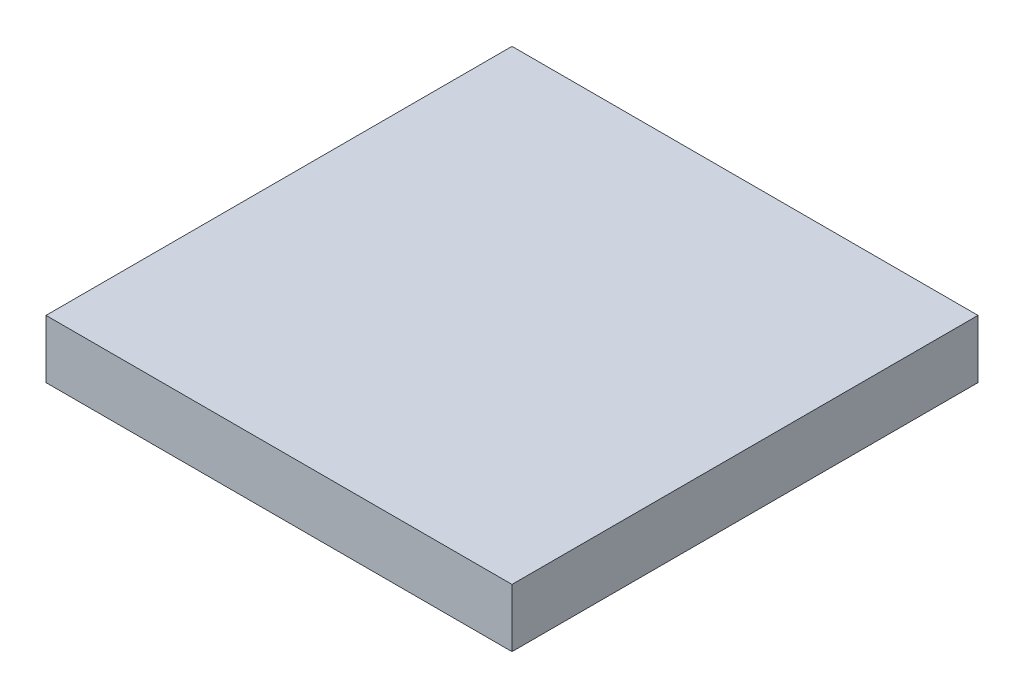
ISO-10303-21;
HEADER;
FILE_DESCRIPTION(('STEP AP214'),'2;1');
FILE_NAME('part.step','',(''),(''),'','','');
FILE_SCHEMA(('AUTOMOTIVE_DESIGN { 1 0 10303 214 1 1 1 1 }'));
ENDSEC;
DATA;
#1=APPLICATION_CONTEXT('core data for automotive mechanical design processes');
#2=APPLICATION_PROTOCOL_DEFINITION('international standard','automotive_design',2000,#1);
#3=PRODUCT_CONTEXT('',#1,'mechanical');
#4=PRODUCT('Part','Part','',(#3));
#5=PRODUCT_RELATED_PRODUCT_CATEGORY('part','',(#4));
#6=PRODUCT_DEFINITION_FORMATION('','',#4);
#7=PRODUCT_DEFINITION_CONTEXT('part definition',#1,'design');
#8=PRODUCT_DEFINITION('design','',#6,#7);
#9=PRODUCT_DEFINITION_SHAPE('','',#8);
#10=(LENGTH_UNIT() NAMED_UNIT(*) SI_UNIT(.MILLI.,.METRE.));
#11=(NAMED_UNIT(*) PLANE_ANGLE_UNIT() SI_UNIT($,.RADIAN.));
#12=(NAMED_UNIT(*) SI_UNIT($,.STERADIAN.) SOLID_ANGLE_UNIT());
#13=UNCERTAINTY_MEASURE_WITH_UNIT(LENGTH_MEASURE(1.E-05),#10,'distance_accuracy_value','');
#14=(GEOMETRIC_REPRESENTATION_CONTEXT(3) GLOBAL_UNCERTAINTY_ASSIGNED_CONTEXT((#13)) GLOBAL_UNIT_ASSIGNED_CONTEXT((#10,
#11,#12)) REPRESENTATION_CONTEXT('',''));
#15=CARTESIAN_POINT('',(0.,0.,0.));
#16=DIRECTION('',(0.,0.,1.));
#17=DIRECTION('',(1.,0.,0.));
#18=AXIS2_PLACEMENT_3D('',#15,#16,#17);
#19=CARTESIAN_POINT('',(12.7,3.175,12.7));
#20=DIRECTION('',(-1.,0.,0.));
#21=DIRECTION('',(0.,0.,1.));
#22=AXIS2_PLACEMENT_3D('',#19,#20,#21);
#23=PLANE('',#22);
#24=DIRECTION('',(0.,0.,-1.));
#25=VECTOR('',#24,1.);
#26=CARTESIAN_POINT('',(12.7,0.,12.7));
#27=LINE('',#26,#25);
#28=CARTESIAN_POINT('',(12.7,0.,12.7));
#29=VERTEX_POINT('',#28);
#30=CARTESIAN_POINT('',(12.7,0.,-12.7));
#31=VERTEX_POINT('',#30);
#32=EDGE_CURVE('E301',#29,#31,#27,.T.);
#33=ORIENTED_EDGE('',*,*,#32,.T.);
#34=DIRECTION('',(0.,-1.,0.));
#35=VECTOR('',#34,1.);
#36=CARTESIAN_POINT('',(12.7,3.175,-12.7));
#37=LINE('',#36,#35);
#38=CARTESIAN_POINT('',(12.7,3.175,-12.7));
#39=VERTEX_POINT('',#38);
#40=EDGE_CURVE('E12',#39,#31,#37,.T.);
#41=ORIENTED_EDGE('',*,*,#40,.F.);
#42=DIRECTION('',(0.,0.,-1.));
#43=VECTOR('',#42,1.);
#44=CARTESIAN_POINT('',(12.7,3.175,12.7));
#45=LINE('',#44,#43);
#46=CARTESIAN_POINT('',(12.7,3.175,12.7));
#47=VERTEX_POINT('',#46);
#48=EDGE_CURVE('E435',#47,#39,#45,.T.);
#49=ORIENTED_EDGE('',*,*,#48,.F.);
#50=DIRECTION('',(0.,-1.,0.));
#51=VECTOR('',#50,1.);
#52=CARTESIAN_POINT('',(12.7,3.175,12.7));
#53=LINE('',#52,#51);
#54=EDGE_CURVE('E445',#47,#29,#53,.T.);
#55=ORIENTED_EDGE('',*,*,#54,.T.);
#56=EDGE_LOOP('',(#33,#41,#49,#55));
#57=FACE_BOUND('',#56,.T.);
#58=ADVANCED_FACE('F60',(#57),#23,.F.);
#59=CARTESIAN_POINT('',(-12.7,3.175,-12.7));
#60=DIRECTION('',(0.,0.,1.));
#61=DIRECTION('',(1.,0.,0.));
#62=AXIS2_PLACEMENT_3D('',#59,#60,#61);
#63=PLANE('',#62);
#64=DIRECTION('',(-1.,0.,0.));
#65=VECTOR('',#64,1.);
#66=CARTESIAN_POINT('',(-12.7,0.,-12.7));
#67=LINE('',#66,#65);
#68=CARTESIAN_POINT('',(-12.7,0.,-12.7));
#69=VERTEX_POINT('',#68);
#70=EDGE_CURVE('E448',#31,#69,#67,.T.);
#71=ORIENTED_EDGE('',*,*,#70,.T.);
#72=DIRECTION('',(0.,-1.,0.));
#73=VECTOR('',#72,1.);
#74=CARTESIAN_POINT('',(-12.7,3.175,-12.7));
#75=LINE('',#74,#73);
#76=CARTESIAN_POINT('',(-12.7,3.175,-12.7));
#77=VERTEX_POINT('',#76);
#78=EDGE_CURVE('E67',#77,#69,#75,.T.);
#79=ORIENTED_EDGE('',*,*,#78,.F.);
#80=DIRECTION('',(-1.,0.,0.));
#81=VECTOR('',#80,1.);
#82=CARTESIAN_POINT('',(-12.7,3.175,-12.7));
#83=LINE('',#82,#81);
#84=EDGE_CURVE('E438',#39,#77,#83,.T.);
#85=ORIENTED_EDGE('',*,*,#84,.F.);
#86=ORIENTED_EDGE('',*,*,#40,.T.);
#87=EDGE_LOOP('',(#71,#79,#85,#86));
#88=FACE_BOUND('',#87,.T.);
#89=ADVANCED_FACE('F478',(#88),#63,.F.);
#90=CARTESIAN_POINT('',(-12.7,3.175,12.7));
#91=DIRECTION('',(1.,0.,0.));
#92=DIRECTION('',(0.,0.,-1.));
#93=AXIS2_PLACEMENT_3D('',#90,#91,#92);
#94=PLANE('',#93);
#95=DIRECTION('',(0.,0.,1.));
#96=VECTOR('',#95,1.);
#97=CARTESIAN_POINT('',(-12.7,0.,12.7));
#98=LINE('',#97,#96);
#99=CARTESIAN_POINT('',(-12.7,0.,12.7));
#100=VERTEX_POINT('',#99);
#101=EDGE_CURVE('E450',#69,#100,#98,.T.);
#102=ORIENTED_EDGE('',*,*,#101,.T.);
#103=DIRECTION('',(0.,-1.,0.));
#104=VECTOR('',#103,1.);
#105=CARTESIAN_POINT('',(-12.7,3.175,12.7));
#106=LINE('',#105,#104);
#107=CARTESIAN_POINT('',(-12.7,3.175,12.7));
#108=VERTEX_POINT('',#107);
#109=EDGE_CURVE('E455',#108,#100,#106,.T.);
#110=ORIENTED_EDGE('',*,*,#109,.F.);
#111=DIRECTION('',(0.,0.,1.));
#112=VECTOR('',#111,1.);
#113=CARTESIAN_POINT('',(-12.7,3.175,12.7));
#114=LINE('',#113,#112);
#115=EDGE_CURVE('E441',#77,#108,#114,.T.);
#116=ORIENTED_EDGE('',*,*,#115,.F.);
#117=ORIENTED_EDGE('',*,*,#78,.T.);
#118=EDGE_LOOP('',(#102,#110,#116,#117));
#119=FACE_BOUND('',#118,.T.);
#120=ADVANCED_FACE('F462',(#119),#94,.F.);
#121=CARTESIAN_POINT('',(-12.7,3.175,12.7));
#122=DIRECTION('',(0.,0.,-1.));
#123=DIRECTION('',(-1.,0.,0.));
#124=AXIS2_PLACEMENT_3D('',#121,#122,#123);
#125=PLANE('',#124);
#126=DIRECTION('',(1.,0.,0.));
#127=VECTOR('',#126,1.);
#128=CARTESIAN_POINT('',(-12.7,0.,12.7));
#129=LINE('',#128,#127);
#130=EDGE_CURVE('E439',#100,#29,#129,.T.);
#131=ORIENTED_EDGE('',*,*,#130,.T.);
#132=ORIENTED_EDGE('',*,*,#54,.F.);
#133=DIRECTION('',(1.,0.,0.));
#134=VECTOR('',#133,1.);
#135=CARTESIAN_POINT('',(-12.7,3.175,12.7));
#136=LINE('',#135,#134);
#137=EDGE_CURVE('E443',#108,#47,#136,.T.);
#138=ORIENTED_EDGE('',*,*,#137,.F.);
#139=ORIENTED_EDGE('',*,*,#109,.T.);
#140=EDGE_LOOP('',(#131,#132,#138,#139));
#141=FACE_BOUND('',#140,.T.);
#142=ADVANCED_FACE('F471',(#141),#125,.F.);
#143=CARTESIAN_POINT('',(0.,3.175,0.));
#144=DIRECTION('',(0.,-1.,0.));
#145=DIRECTION('',(0.,0.,-1.));
#146=AXIS2_PLACEMENT_3D('',#143,#144,#145);
#147=PLANE('',#146);
#148=ORIENTED_EDGE('',*,*,#48,.T.);
#149=ORIENTED_EDGE('',*,*,#84,.T.);
#150=ORIENTED_EDGE('',*,*,#115,.T.);
#151=ORIENTED_EDGE('',*,*,#137,.T.);
#152=EDGE_LOOP('',(#148,#149,#150,#151));
#153=FACE_BOUND('',#152,.T.);
#154=ADVANCED_FACE('F477',(#153),#147,.F.);
#155=CARTESIAN_POINT('',(0.,0.,0.));
#156=DIRECTION('',(0.,-1.,0.));
#157=DIRECTION('',(0.,0.,-1.));
#158=AXIS2_PLACEMENT_3D('',#155,#156,#157);
#159=PLANE('',#158);
#160=CARTESIAN_POINT('',(-11.1125,0.,1.5875));
#161=DIRECTION('',(0.,-1.,0.));
#162=DIRECTION('',(0.,0.,-1.));
#163=AXIS2_PLACEMENT_3D('',#160,#161,#162);
#164=CIRCLE('',#163,0.793749999999999);
#165=CARTESIAN_POINT('',(-10.31875,0.,1.5875));
#166=VERTEX_POINT('',#165);
#167=CARTESIAN_POINT('',(-11.1125,0.,0.793750000000005));
#168=VERTEX_POINT('',#167);
#169=EDGE_CURVE('E74',#166,#168,#164,.T.);
#170=ORIENTED_EDGE('',*,*,#169,.F.);
#171=DIRECTION('',(1.,0.,0.));
#172=VECTOR('',#171,1.);
#173=CARTESIAN_POINT('',(0.,0.,1.5875));
#174=LINE('',#173,#172);
#175=CARTESIAN_POINT('',(-8.73124999999999,0.,1.5875));
#176=VERTEX_POINT('',#175);
#177=EDGE_CURVE('E264',#166,#176,#174,.T.);
#178=ORIENTED_EDGE('',*,*,#177,.T.);
#179=CARTESIAN_POINT('',(-7.93749999999999,0.,1.58749999999999));
#180=DIRECTION('',(0.,-1.,0.));
#181=DIRECTION('',(0.,0.,-1.));
#182=AXIS2_PLACEMENT_3D('',#179,#180,#181);
#183=CIRCLE('',#182,0.79375);
#184=CARTESIAN_POINT('',(-7.9375,0.,0.793749999999989));
#185=VERTEX_POINT('',#184);
#186=EDGE_CURVE('E267',#185,#176,#183,.T.);
#187=ORIENTED_EDGE('',*,*,#186,.F.);
#188=DIRECTION('',(0.,0.,-1.));
#189=VECTOR('',#188,1.);
#190=CARTESIAN_POINT('',(-7.9375,0.,0.));
#191=LINE('',#190,#189);
#192=CARTESIAN_POINT('',(-7.9375,0.,-0.793750000000015));
#193=VERTEX_POINT('',#192);
#194=EDGE_CURVE('E294',#185,#193,#191,.T.);
#195=ORIENTED_EDGE('',*,*,#194,.T.);
#196=CARTESIAN_POINT('',(-7.93750000000002,0.,-1.58750000000002));
#197=DIRECTION('',(0.,-1.,0.));
#198=DIRECTION('',(0.,0.,-1.));
#199=AXIS2_PLACEMENT_3D('',#196,#197,#198);
#200=CIRCLE('',#199,0.793750000000001);
#201=CARTESIAN_POINT('',(-8.73125000000002,0.,-1.5875));
#202=VERTEX_POINT('',#201);
#203=EDGE_CURVE('E291',#202,#193,#200,.T.);
#204=ORIENTED_EDGE('',*,*,#203,.F.);
#205=DIRECTION('',(1.,0.,0.));
#206=VECTOR('',#205,1.);
#207=CARTESIAN_POINT('',(0.,0.,-1.5875));
#208=LINE('',#207,#206);
#209=CARTESIAN_POINT('',(-10.31875,0.,-1.5875));
#210=VERTEX_POINT('',#209);
#211=EDGE_CURVE('E288',#210,#202,#208,.T.);
#212=ORIENTED_EDGE('',*,*,#211,.F.);
#213=CARTESIAN_POINT('',(-11.1125,0.,-1.5875));
#214=DIRECTION('',(0.,-1.,0.));
#215=DIRECTION('',(0.,0.,-1.));
#216=AXIS2_PLACEMENT_3D('',#213,#214,#215);
#217=CIRCLE('',#216,0.793749999999999);
#218=CARTESIAN_POINT('',(-11.1125,0.,-0.79375));
#219=VERTEX_POINT('',#218);
#220=EDGE_CURVE('E285',#219,#210,#217,.T.);
#221=ORIENTED_EDGE('',*,*,#220,.F.);
#222=DIRECTION('',(0.,0.,-1.));
#223=VECTOR('',#222,1.);
#224=CARTESIAN_POINT('',(-11.1125,0.,0.));
#225=LINE('',#224,#223);
#226=EDGE_CURVE('E283',#168,#219,#225,.T.);
#227=ORIENTED_EDGE('',*,*,#226,.F.);
#228=EDGE_LOOP('',(#170,#178,#187,#195,#204,#212,#221,#227));
#229=FACE_BOUND('',#228,.T.);
#230=CARTESIAN_POINT('',(6.93106532850716,0.,8.82995729955647));
#231=DIRECTION('',(0.,-1.,0.));
#232=DIRECTION('',(0.,0.,-1.));
#233=AXIS2_PLACEMENT_3D('',#230,#231,#232);
#234=CIRCLE('',#233,0.793749999998903);
#235=CARTESIAN_POINT('',(6.53419032850771,0.,8.14254963530352));
#236=VERTEX_POINT('',#235);
#237=CARTESIAN_POINT('',(6.24365766425421,0.,9.22683229955592));
#238=VERTEX_POINT('',#237);
#239=EDGE_CURVE('E82',#236,#238,#234,.T.);
#240=ORIENTED_EDGE('',*,*,#239,.F.);
#241=DIRECTION('',(-0.5,0.,-0.866025403784439));
#242=VECTOR('',#241,1.);
#243=CARTESIAN_POINT('',(1.3748153285065,0.,-0.793749999999254));
#244=LINE('',#243,#242);
#245=CARTESIAN_POINT('',(5.7404403285063,0.,6.76773430679328));
#246=VERTEX_POINT('',#245);
#247=EDGE_CURVE('E331',#236,#246,#244,.T.);
#248=ORIENTED_EDGE('',*,*,#247,.T.);
#249=CARTESIAN_POINT('',(5.34356532850717,0.,6.08032664254088));
#250=DIRECTION('',(0.,-1.,0.));
#251=DIRECTION('',(0.,0.,-1.));
#252=AXIS2_PLACEMENT_3D('',#249,#250,#251);
#253=CIRCLE('',#252,0.793749999998273);
#254=CARTESIAN_POINT('',(4.65615766425476,0.,6.47720164254001));
#255=VERTEX_POINT('',#254);
#256=EDGE_CURVE('E334',#255,#246,#253,.T.);
#257=ORIENTED_EDGE('',*,*,#256,.F.);
#258=DIRECTION('',(-0.866025403784439,0.,0.499999999999999));
#259=VECTOR('',#258,1.);
#260=CARTESIAN_POINT('',(3.96875000000065,0.,6.87407664254013));
#261=LINE('',#260,#259);
#262=CARTESIAN_POINT('',(3.2813423357464,0.,7.27095164254034));
#263=VERTEX_POINT('',#262);
#264=EDGE_CURVE('E338',#255,#263,#261,.T.);
#265=ORIENTED_EDGE('',*,*,#264,.T.);
#266=CARTESIAN_POINT('',(2.59393467149157,0.,7.66782664254088));
#267=DIRECTION('',(0.,-1.,0.));
#268=DIRECTION('',(0.,0.,-1.));
#269=AXIS2_PLACEMENT_3D('',#266,#267,#268);
#270=CIRCLE('',#269,0.793750000001067);
#271=CARTESIAN_POINT('',(2.99080967149211,0.,8.3552343067957));
#272=VERTEX_POINT('',#271);
#273=EDGE_CURVE('E341',#272,#263,#270,.T.);
#274=ORIENTED_EDGE('',*,*,#273,.F.);
#275=DIRECTION('',(-0.5,0.,-0.866025403784439));
#276=VECTOR('',#275,1.);
#277=CARTESIAN_POINT('',(-1.37481532850909,0.,0.793750000000747));
#278=LINE('',#277,#276);
#279=CARTESIAN_POINT('',(3.78455967149072,0.,9.73004963530109));
#280=VERTEX_POINT('',#279);
#281=EDGE_CURVE('E344',#280,#272,#278,.T.);
#282=ORIENTED_EDGE('',*,*,#281,.F.);
#283=CARTESIAN_POINT('',(4.18143467149157,0.,10.4174572995565));
#284=DIRECTION('',(0.,-1.,0.));
#285=DIRECTION('',(0.,0.,-1.));
#286=AXIS2_PLACEMENT_3D('',#283,#284,#285);
#287=CIRCLE('',#286,0.793750000001707);
#288=CARTESIAN_POINT('',(4.86884233574695,0.,10.0205822995556));
#289=VERTEX_POINT('',#288);
#290=EDGE_CURVE('E347',#289,#280,#287,.T.);
#291=ORIENTED_EDGE('',*,*,#290,.F.);
#292=DIRECTION('',(-0.866025403784439,0.,0.499999999999999));
#293=VECTOR('',#292,1.);
#294=CARTESIAN_POINT('',(5.55625000000065,0.,9.62370729955573));
#295=LINE('',#294,#293);
#296=EDGE_CURVE('E350',#238,#289,#295,.T.);
#297=ORIENTED_EDGE('',*,*,#296,.F.);
#298=EDGE_LOOP('',(#240,#248,#257,#265,#274,#282,#291,#297));
#299=FACE_BOUND('',#298,.T.);
#300=CARTESIAN_POINT('',(6.93106532850912,0.,-8.82995729955308));
#301=DIRECTION('',(0.,-1.,0.));
#302=DIRECTION('',(0.,0.,-1.));
#303=AXIS2_PLACEMENT_3D('',#300,#301,#302);
#304=CIRCLE('',#303,0.793749999999967);
#305=CARTESIAN_POINT('',(6.24365766425526,0.,-9.22683229955306));
#306=VERTEX_POINT('',#305);
#307=CARTESIAN_POINT('',(6.53419032850914,0.,-8.14254963529921));
#308=VERTEX_POINT('',#307);
#309=EDGE_CURVE('E408',#306,#308,#304,.T.);
#310=ORIENTED_EDGE('',*,*,#309,.F.);
#311=DIRECTION('',(0.866025403784438,0.,0.500000000000001));
#312=VECTOR('',#311,1.);
#313=CARTESIAN_POINT('',(5.5562499999997,0.,-9.62370729955402));
#314=LINE('',#313,#312);
#315=CARTESIAN_POINT('',(4.86884233574562,0.,-10.0205822995541));
#316=VERTEX_POINT('',#315);
#317=EDGE_CURVE('E410',#316,#306,#314,.T.);
#318=ORIENTED_EDGE('',*,*,#317,.F.);
#319=CARTESIAN_POINT('',(4.18143467149353,0.,-10.4174572995531));
#320=DIRECTION('',(0.,-1.,0.));
#321=DIRECTION('',(0.,0.,-1.));
#322=AXIS2_PLACEMENT_3D('',#319,#320,#321);
#323=CIRCLE('',#322,0.793749999997901);
#324=CARTESIAN_POINT('',(3.78455967149458,0.,-9.730049635301));
#325=VERTEX_POINT('',#324);
#326=EDGE_CURVE('E330',#325,#316,#323,.T.);
#327=ORIENTED_EDGE('',*,*,#326,.F.);
#328=DIRECTION('',(-0.5,0.,0.866025403784438));
#329=VECTOR('',#328,1.);
#330=CARTESIAN_POINT('',(-1.37481532850616,0.,-0.793749999999055));
#331=LINE('',#330,#329);
#332=CARTESIAN_POINT('',(2.99080967149353,0.,-8.35523430679139));
#333=VERTEX_POINT('',#332);
#334=EDGE_CURVE('E392',#325,#333,#331,.T.);
#335=ORIENTED_EDGE('',*,*,#334,.T.);
#336=CARTESIAN_POINT('',(2.59393467149353,0.,-7.66782664253749));
#337=DIRECTION('',(0.,-1.,0.));
#338=DIRECTION('',(0.,0.,-1.));
#339=AXIS2_PLACEMENT_3D('',#336,#337,#338);
#340=CIRCLE('',#339,0.793750000000004);
#341=CARTESIAN_POINT('',(3.28134233574743,0.,-7.27095164253749));
#342=VERTEX_POINT('',#341);
#343=EDGE_CURVE('E395',#342,#333,#340,.T.);
#344=ORIENTED_EDGE('',*,*,#343,.F.);
#345=DIRECTION('',(0.866025403784438,0.,0.500000000000002));
#346=VECTOR('',#345,1.);
#347=CARTESIAN_POINT('',(3.9687499999997,0.,-6.87407664253843));
#348=LINE('',#347,#346);
#349=CARTESIAN_POINT('',(4.65615766425344,0.,-6.47720164253852));
#350=VERTEX_POINT('',#349);
#351=EDGE_CURVE('E399',#342,#350,#348,.T.);
#352=ORIENTED_EDGE('',*,*,#351,.T.);
#353=CARTESIAN_POINT('',(5.34356532850912,0.,-6.08032664253749));
#354=DIRECTION('',(0.,-1.,0.));
#355=DIRECTION('',(0.,0.,-1.));
#356=AXIS2_PLACEMENT_3D('',#353,#354,#355);
#357=CIRCLE('',#356,0.79375000000206);
#358=CARTESIAN_POINT('',(5.74044032851016,0.,-6.76773430679317));
#359=VERTEX_POINT('',#358);
#360=EDGE_CURVE('E402',#359,#350,#357,.T.);
#361=ORIENTED_EDGE('',*,*,#360,.F.);
#362=DIRECTION('',(-0.500000000000001,0.,0.866025403784438));
#363=VECTOR('',#362,1.);
#364=CARTESIAN_POINT('',(1.37481532850943,0.,0.793750000000946));
#365=LINE('',#364,#363);
#366=EDGE_CURVE('E405',#308,#359,#365,.T.);
#367=ORIENTED_EDGE('',*,*,#366,.F.);
#368=EDGE_LOOP('',(#310,#318,#327,#335,#344,#352,#361,#367));
#369=FACE_BOUND('',#368,.T.);
#370=ORIENTED_EDGE('',*,*,#32,.F.);
#371=ORIENTED_EDGE('',*,*,#130,.F.);
#372=ORIENTED_EDGE('',*,*,#101,.F.);
#373=ORIENTED_EDGE('',*,*,#70,.F.);
#374=EDGE_LOOP('',(#370,#371,#372,#373));
#375=FACE_BOUND('',#374,.T.);
#376=ADVANCED_FACE('F468',(#229,#299,#369,#375),#159,.T.);
#377=CARTESIAN_POINT('',(6.93106532850912,1.5875,-8.82995729955308));
#378=DIRECTION('',(0.,-1.,0.));
#379=DIRECTION('',(0.,0.,-1.));
#380=AXIS2_PLACEMENT_3D('',#377,#378,#379);
#381=CYLINDRICAL_SURFACE('',#380,0.793749999999967);
#382=ORIENTED_EDGE('',*,*,#309,.T.);
#383=DIRECTION('',(0.,-1.,0.));
#384=VECTOR('',#383,1.);
#385=CARTESIAN_POINT('',(6.53419032850914,1.5875,-8.14254963529921));
#386=LINE('',#385,#384);
#387=CARTESIAN_POINT('',(6.53419032850914,1.5875,-8.14254963529921));
#388=VERTEX_POINT('',#387);
#389=EDGE_CURVE('E379',#388,#308,#386,.T.);
#390=ORIENTED_EDGE('',*,*,#389,.F.);
#391=CARTESIAN_POINT('',(6.93106532850912,1.5875,-8.82995729955308));
#392=DIRECTION('',(0.,-1.,0.));
#393=DIRECTION('',(0.,0.,-1.));
#394=AXIS2_PLACEMENT_3D('',#391,#392,#393);
#395=CIRCLE('',#394,0.793749999999967);
#396=CARTESIAN_POINT('',(6.24365766425526,1.5875,-9.22683229955306));
#397=VERTEX_POINT('',#396);
#398=EDGE_CURVE('E427',#397,#388,#395,.T.);
#399=ORIENTED_EDGE('',*,*,#398,.F.);
#400=DIRECTION('',(0.,-1.,0.));
#401=VECTOR('',#400,1.);
#402=CARTESIAN_POINT('',(6.24365766425526,1.5875,-9.22683229955306));
#403=LINE('',#402,#401);
#404=EDGE_CURVE('E377',#397,#306,#403,.T.);
#405=ORIENTED_EDGE('',*,*,#404,.T.);
#406=EDGE_LOOP('',(#382,#390,#399,#405));
#407=FACE_BOUND('',#406,.T.);
#408=ADVANCED_FACE('F490',(#407),#381,.F.);
#409=CARTESIAN_POINT('',(0.,1.5875,0.));
#410=DIRECTION('',(0.,-1.,0.));
#411=DIRECTION('',(0.,0.,-1.));
#412=AXIS2_PLACEMENT_3D('',#409,#410,#411);
#413=PLANE('',#412);
#414=ORIENTED_EDGE('',*,*,#398,.T.);
#415=DIRECTION('',(-0.500000000000001,0.,0.866025403784438));
#416=VECTOR('',#415,1.);
#417=CARTESIAN_POINT('',(1.37481532850943,1.5875,0.793750000000946));
#418=LINE('',#417,#416);
#419=CARTESIAN_POINT('',(5.74044032851016,1.5875,-6.76773430679317));
#420=VERTEX_POINT('',#419);
#421=EDGE_CURVE('E424',#388,#420,#418,.T.);
#422=ORIENTED_EDGE('',*,*,#421,.T.);
#423=CARTESIAN_POINT('',(5.34356532850912,1.5875,-6.08032664253749));
#424=DIRECTION('',(0.,-1.,0.));
#425=DIRECTION('',(0.,0.,-1.));
#426=AXIS2_PLACEMENT_3D('',#423,#424,#425);
#427=CIRCLE('',#426,0.79375000000206);
#428=CARTESIAN_POINT('',(4.65615766425344,1.5875,-6.47720164253852));
#429=VERTEX_POINT('',#428);
#430=EDGE_CURVE('E421',#420,#429,#427,.T.);
#431=ORIENTED_EDGE('',*,*,#430,.T.);
#432=DIRECTION('',(0.866025403784438,0.,0.500000000000002));
#433=VECTOR('',#432,1.);
#434=CARTESIAN_POINT('',(3.9687499999997,1.5875,-6.87407664253843));
#435=LINE('',#434,#433);
#436=CARTESIAN_POINT('',(3.28134233574743,1.5875,-7.27095164253749));
#437=VERTEX_POINT('',#436);
#438=EDGE_CURVE('E419',#437,#429,#435,.T.);
#439=ORIENTED_EDGE('',*,*,#438,.F.);
#440=CARTESIAN_POINT('',(2.59393467149353,1.5875,-7.66782664253749));
#441=DIRECTION('',(0.,-1.,0.));
#442=DIRECTION('',(0.,0.,-1.));
#443=AXIS2_PLACEMENT_3D('',#440,#441,#442);
#444=CIRCLE('',#443,0.793750000000004);
#445=CARTESIAN_POINT('',(2.99080967149353,1.5875,-8.35523430679139));
#446=VERTEX_POINT('',#445);
#447=EDGE_CURVE('E416',#437,#446,#444,.T.);
#448=ORIENTED_EDGE('',*,*,#447,.T.);
#449=DIRECTION('',(-0.5,0.,0.866025403784438));
#450=VECTOR('',#449,1.);
#451=CARTESIAN_POINT('',(-1.37481532850616,1.5875,-0.793749999999055));
#452=LINE('',#451,#450);
#453=CARTESIAN_POINT('',(3.78455967149458,1.5875,-9.730049635301));
#454=VERTEX_POINT('',#453);
#455=EDGE_CURVE('E376',#454,#446,#452,.T.);
#456=ORIENTED_EDGE('',*,*,#455,.F.);
#457=CARTESIAN_POINT('',(4.18143467149353,1.5875,-10.4174572995531));
#458=DIRECTION('',(0.,-1.,0.));
#459=DIRECTION('',(0.,0.,-1.));
#460=AXIS2_PLACEMENT_3D('',#457,#458,#459);
#461=CIRCLE('',#460,0.793749999997901);
#462=CARTESIAN_POINT('',(4.86884233574562,1.5875,-10.0205822995541));
#463=VERTEX_POINT('',#462);
#464=EDGE_CURVE('E396',#454,#463,#461,.T.);
#465=ORIENTED_EDGE('',*,*,#464,.T.);
#466=DIRECTION('',(0.866025403784438,0.,0.500000000000001));
#467=VECTOR('',#466,1.);
#468=CARTESIAN_POINT('',(5.5562499999997,1.5875,-9.62370729955402));
#469=LINE('',#468,#467);
#470=EDGE_CURVE('E430',#463,#397,#469,.T.);
#471=ORIENTED_EDGE('',*,*,#470,.T.);
#472=EDGE_LOOP('',(#414,#422,#431,#439,#448,#456,#465,#471));
#473=FACE_BOUND('',#472,.T.);
#474=ADVANCED_FACE('F494',(#473),#413,.T.);
#475=CARTESIAN_POINT('',(5.5562499999997,1.5875,-9.62370729955402));
#476=DIRECTION('',(0.500000000000001,0.,-0.866025403784438));
#477=DIRECTION('',(-0.866025403784438,0.,-0.500000000000001));
#478=AXIS2_PLACEMENT_3D('',#475,#476,#477);
#479=PLANE('',#478);
#480=ORIENTED_EDGE('',*,*,#317,.T.);
#481=ORIENTED_EDGE('',*,*,#404,.F.);
#482=ORIENTED_EDGE('',*,*,#470,.F.);
#483=DIRECTION('',(0.,-1.,0.));
#484=VECTOR('',#483,1.);
#485=CARTESIAN_POINT('',(4.86884233574562,1.5875,-10.0205822995541));
#486=LINE('',#485,#484);
#487=EDGE_CURVE('E374',#463,#316,#486,.T.);
#488=ORIENTED_EDGE('',*,*,#487,.T.);
#489=EDGE_LOOP('',(#480,#481,#482,#488));
#490=FACE_BOUND('',#489,.T.);
#491=ADVANCED_FACE('F497',(#490),#479,.F.);
#492=CARTESIAN_POINT('',(4.18143467149353,1.5875,-10.4174572995531));
#493=DIRECTION('',(0.,-1.,0.));
#494=DIRECTION('',(0.,0.,-1.));
#495=AXIS2_PLACEMENT_3D('',#492,#493,#494);
#496=CYLINDRICAL_SURFACE('',#495,0.793749999997901);
#497=ORIENTED_EDGE('',*,*,#326,.T.);
#498=ORIENTED_EDGE('',*,*,#487,.F.);
#499=ORIENTED_EDGE('',*,*,#464,.F.);
#500=DIRECTION('',(0.,-1.,0.));
#501=VECTOR('',#500,1.);
#502=CARTESIAN_POINT('',(3.78455967149458,1.5875,-9.730049635301));
#503=LINE('',#502,#501);
#504=EDGE_CURVE('E390',#454,#325,#503,.T.);
#505=ORIENTED_EDGE('',*,*,#504,.T.);
#506=EDGE_LOOP('',(#497,#498,#499,#505));
#507=FACE_BOUND('',#506,.T.);
#508=ADVANCED_FACE('F505',(#507),#496,.F.);
#509=CARTESIAN_POINT('',(-1.37481532850616,1.5875,-0.793749999999055));
#510=DIRECTION('',(0.866025403784438,0.,0.5));
#511=DIRECTION('',(0.500000000000001,0.,-0.866025403784438));
#512=AXIS2_PLACEMENT_3D('',#509,#510,#511);
#513=PLANE('',#512);
#514=ORIENTED_EDGE('',*,*,#334,.F.);
#515=ORIENTED_EDGE('',*,*,#504,.F.);
#516=ORIENTED_EDGE('',*,*,#455,.T.);
#517=DIRECTION('',(0.,-1.,0.));
#518=VECTOR('',#517,1.);
#519=CARTESIAN_POINT('',(2.99080967149353,1.5875,-8.35523430679139));
#520=LINE('',#519,#518);
#521=EDGE_CURVE('E388',#446,#333,#520,.T.);
#522=ORIENTED_EDGE('',*,*,#521,.T.);
#523=EDGE_LOOP('',(#514,#515,#516,#522));
#524=FACE_BOUND('',#523,.T.);
#525=ADVANCED_FACE('F501',(#524),#513,.T.);
#526=CARTESIAN_POINT('',(2.59393467149353,1.5875,-7.66782664253749));
#527=DIRECTION('',(0.,-1.,0.));
#528=DIRECTION('',(0.,0.,-1.));
#529=AXIS2_PLACEMENT_3D('',#526,#527,#528);
#530=CYLINDRICAL_SURFACE('',#529,0.793750000000004);
#531=ORIENTED_EDGE('',*,*,#343,.T.);
#532=ORIENTED_EDGE('',*,*,#521,.F.);
#533=ORIENTED_EDGE('',*,*,#447,.F.);
#534=DIRECTION('',(0.,-1.,0.));
#535=VECTOR('',#534,1.);
#536=CARTESIAN_POINT('',(3.28134233574743,1.5875,-7.27095164253749));
#537=LINE('',#536,#535);
#538=EDGE_CURVE('E386',#437,#342,#537,.T.);
#539=ORIENTED_EDGE('',*,*,#538,.T.);
#540=EDGE_LOOP('',(#531,#532,#533,#539));
#541=FACE_BOUND('',#540,.T.);
#542=ADVANCED_FACE('F504',(#541),#530,.F.);
#543=CARTESIAN_POINT('',(3.9687499999997,1.5875,-6.87407664253843));
#544=DIRECTION('',(0.500000000000001,0.,-0.866025403784438));
#545=DIRECTION('',(-0.866025403784438,0.,-0.500000000000002));
#546=AXIS2_PLACEMENT_3D('',#543,#544,#545);
#547=PLANE('',#546);
#548=ORIENTED_EDGE('',*,*,#351,.F.);
#549=ORIENTED_EDGE('',*,*,#538,.F.);
#550=ORIENTED_EDGE('',*,*,#438,.T.);
#551=DIRECTION('',(0.,-1.,0.));
#552=VECTOR('',#551,1.);
#553=CARTESIAN_POINT('',(4.65615766425344,1.5875,-6.47720164253852));
#554=LINE('',#553,#552);
#555=EDGE_CURVE('E384',#429,#350,#554,.T.);
#556=ORIENTED_EDGE('',*,*,#555,.T.);
#557=EDGE_LOOP('',(#548,#549,#550,#556));
#558=FACE_BOUND('',#557,.T.);
#559=ADVANCED_FACE('F509',(#558),#547,.T.);
#560=CARTESIAN_POINT('',(5.34356532850912,1.5875,-6.08032664253749));
#561=DIRECTION('',(0.,-1.,0.));
#562=DIRECTION('',(0.,0.,-1.));
#563=AXIS2_PLACEMENT_3D('',#560,#561,#562);
#564=CYLINDRICAL_SURFACE('',#563,0.79375000000206);
#565=ORIENTED_EDGE('',*,*,#360,.T.);
#566=ORIENTED_EDGE('',*,*,#555,.F.);
#567=ORIENTED_EDGE('',*,*,#430,.F.);
#568=DIRECTION('',(0.,-1.,0.));
#569=VECTOR('',#568,1.);
#570=CARTESIAN_POINT('',(5.74044032851016,1.5875,-6.76773430679317));
#571=LINE('',#570,#569);
#572=EDGE_CURVE('E382',#420,#359,#571,.T.);
#573=ORIENTED_EDGE('',*,*,#572,.T.);
#574=EDGE_LOOP('',(#565,#566,#567,#573));
#575=FACE_BOUND('',#574,.T.);
#576=ADVANCED_FACE('F513',(#575),#564,.F.);
#577=CARTESIAN_POINT('',(1.37481532850943,1.5875,0.793750000000946));
#578=DIRECTION('',(0.866025403784438,0.,0.500000000000001));
#579=DIRECTION('',(0.500000000000001,0.,-0.866025403784438));
#580=AXIS2_PLACEMENT_3D('',#577,#578,#579);
#581=PLANE('',#580);
#582=ORIENTED_EDGE('',*,*,#366,.T.);
#583=ORIENTED_EDGE('',*,*,#572,.F.);
#584=ORIENTED_EDGE('',*,*,#421,.F.);
#585=ORIENTED_EDGE('',*,*,#389,.T.);
#586=EDGE_LOOP('',(#582,#583,#584,#585));
#587=FACE_BOUND('',#586,.T.);
#588=ADVANCED_FACE('F500',(#587),#581,.F.);
#589=CARTESIAN_POINT('',(6.93106532850716,1.5875,8.82995729955647));
#590=DIRECTION('',(0.,-1.,0.));
#591=DIRECTION('',(0.,0.,-1.));
#592=AXIS2_PLACEMENT_3D('',#589,#590,#591);
#593=CYLINDRICAL_SURFACE('',#592,0.793749999998903);
#594=ORIENTED_EDGE('',*,*,#239,.T.);
#595=DIRECTION('',(0.,-1.,0.));
#596=VECTOR('',#595,1.);
#597=CARTESIAN_POINT('',(6.24365766425421,1.5875,9.22683229955592));
#598=LINE('',#597,#596);
#599=CARTESIAN_POINT('',(6.24365766425421,1.5875,9.22683229955592));
#600=VERTEX_POINT('',#599);
#601=EDGE_CURVE('E313',#600,#238,#598,.T.);
#602=ORIENTED_EDGE('',*,*,#601,.F.);
#603=CARTESIAN_POINT('',(6.93106532850716,1.5875,8.82995729955647));
#604=DIRECTION('',(0.,-1.,0.));
#605=DIRECTION('',(0.,0.,-1.));
#606=AXIS2_PLACEMENT_3D('',#603,#604,#605);
#607=CIRCLE('',#606,0.793749999998903);
#608=CARTESIAN_POINT('',(6.53419032850771,1.5875,8.14254963530352));
#609=VERTEX_POINT('',#608);
#610=EDGE_CURVE('E335',#609,#600,#607,.T.);
#611=ORIENTED_EDGE('',*,*,#610,.F.);
#612=DIRECTION('',(0.,-1.,0.));
#613=VECTOR('',#612,1.);
#614=CARTESIAN_POINT('',(6.53419032850771,1.5875,8.14254963530352));
#615=LINE('',#614,#613);
#616=EDGE_CURVE('E328',#609,#236,#615,.T.);
#617=ORIENTED_EDGE('',*,*,#616,.T.);
#618=EDGE_LOOP('',(#594,#602,#611,#617));
#619=FACE_BOUND('',#618,.T.);
#620=ADVANCED_FACE('F499',(#619),#593,.F.);
#621=CARTESIAN_POINT('',(1.3748153285065,1.5875,-0.793749999999254));
#622=DIRECTION('',(-0.866025403784439,0.,0.5));
#623=DIRECTION('',(0.5,0.,0.866025403784439));
#624=AXIS2_PLACEMENT_3D('',#621,#622,#623);
#625=PLANE('',#624);
#626=ORIENTED_EDGE('',*,*,#247,.F.);
#627=ORIENTED_EDGE('',*,*,#616,.F.);
#628=DIRECTION('',(-0.5,0.,-0.866025403784439));
#629=VECTOR('',#628,1.);
#630=CARTESIAN_POINT('',(1.3748153285065,1.5875,-0.793749999999254));
#631=LINE('',#630,#629);
#632=CARTESIAN_POINT('',(5.7404403285063,1.5875,6.76773430679328));
#633=VERTEX_POINT('',#632);
#634=EDGE_CURVE('E315',#609,#633,#631,.T.);
#635=ORIENTED_EDGE('',*,*,#634,.T.);
#636=DIRECTION('',(0.,-1.,0.));
#637=VECTOR('',#636,1.);
#638=CARTESIAN_POINT('',(5.7404403285063,1.5875,6.76773430679328));
#639=LINE('',#638,#637);
#640=EDGE_CURVE('E326',#633,#246,#639,.T.);
#641=ORIENTED_EDGE('',*,*,#640,.T.);
#642=EDGE_LOOP('',(#626,#627,#635,#641));
#643=FACE_BOUND('',#642,.T.);
#644=ADVANCED_FACE('F535',(#643),#625,.T.);
#645=CARTESIAN_POINT('',(5.34356532850717,1.5875,6.08032664254088));
#646=DIRECTION('',(0.,-1.,0.));
#647=DIRECTION('',(0.,0.,-1.));
#648=AXIS2_PLACEMENT_3D('',#645,#646,#647);
#649=CYLINDRICAL_SURFACE('',#648,0.793749999998273);
#650=ORIENTED_EDGE('',*,*,#256,.T.);
#651=ORIENTED_EDGE('',*,*,#640,.F.);
#652=CARTESIAN_POINT('',(5.34356532850717,1.5875,6.08032664254088));
#653=DIRECTION('',(0.,-1.,0.));
#654=DIRECTION('',(0.,0.,-1.));
#655=AXIS2_PLACEMENT_3D('',#652,#653,#654);
#656=CIRCLE('',#655,0.793749999998273);
#657=CARTESIAN_POINT('',(4.65615766425476,1.5875,6.47720164254001));
#658=VERTEX_POINT('',#657);
#659=EDGE_CURVE('E355',#658,#633,#656,.T.);
#660=ORIENTED_EDGE('',*,*,#659,.F.);
#661=DIRECTION('',(0.,-1.,0.));
#662=VECTOR('',#661,1.);
#663=CARTESIAN_POINT('',(4.65615766425476,1.5875,6.47720164254001));
#664=LINE('',#663,#662);
#665=EDGE_CURVE('E324',#658,#255,#664,.T.);
#666=ORIENTED_EDGE('',*,*,#665,.T.);
#667=EDGE_LOOP('',(#650,#651,#660,#666));
#668=FACE_BOUND('',#667,.T.);
#669=ADVANCED_FACE('F538',(#668),#649,.F.);
#670=CARTESIAN_POINT('',(3.96875000000065,1.5875,6.87407664254013));
#671=DIRECTION('',(0.499999999999999,0.,0.866025403784439));
#672=DIRECTION('',(0.866025403784439,0.,-0.499999999999999));
#673=AXIS2_PLACEMENT_3D('',#670,#671,#672);
#674=PLANE('',#673);
#675=ORIENTED_EDGE('',*,*,#264,.F.);
#676=ORIENTED_EDGE('',*,*,#665,.F.);
#677=DIRECTION('',(-0.866025403784439,0.,0.499999999999999));
#678=VECTOR('',#677,1.);
#679=CARTESIAN_POINT('',(3.96875000000065,1.5875,6.87407664254013));
#680=LINE('',#679,#678);
#681=CARTESIAN_POINT('',(3.2813423357464,1.5875,7.27095164254034));
#682=VERTEX_POINT('',#681);
#683=EDGE_CURVE('E358',#658,#682,#680,.T.);
#684=ORIENTED_EDGE('',*,*,#683,.T.);
#685=DIRECTION('',(0.,-1.,0.));
#686=VECTOR('',#685,1.);
#687=CARTESIAN_POINT('',(3.2813423357464,1.5875,7.27095164254034));
#688=LINE('',#687,#686);
#689=EDGE_CURVE('E322',#682,#263,#688,.T.);
#690=ORIENTED_EDGE('',*,*,#689,.T.);
#691=EDGE_LOOP('',(#675,#676,#684,#690));
#692=FACE_BOUND('',#691,.T.);
#693=ADVANCED_FACE('F542',(#692),#674,.T.);
#694=CARTESIAN_POINT('',(2.59393467149157,1.5875,7.66782664254088));
#695=DIRECTION('',(0.,-1.,0.));
#696=DIRECTION('',(0.,0.,-1.));
#697=AXIS2_PLACEMENT_3D('',#694,#695,#696);
#698=CYLINDRICAL_SURFACE('',#697,0.793750000001067);
#699=ORIENTED_EDGE('',*,*,#273,.T.);
#700=ORIENTED_EDGE('',*,*,#689,.F.);
#701=CARTESIAN_POINT('',(2.59393467149157,1.5875,7.66782664254088));
#702=DIRECTION('',(0.,-1.,0.));
#703=DIRECTION('',(0.,0.,-1.));
#704=AXIS2_PLACEMENT_3D('',#701,#702,#703);
#705=CIRCLE('',#704,0.793750000001067);
#706=CARTESIAN_POINT('',(2.99080967149211,1.5875,8.3552343067957));
#707=VERTEX_POINT('',#706);
#708=EDGE_CURVE('E360',#707,#682,#705,.T.);
#709=ORIENTED_EDGE('',*,*,#708,.F.);
#710=DIRECTION('',(0.,-1.,0.));
#711=VECTOR('',#710,1.);
#712=CARTESIAN_POINT('',(2.99080967149211,1.5875,8.3552343067957));
#713=LINE('',#712,#711);
#714=EDGE_CURVE('E320',#707,#272,#713,.T.);
#715=ORIENTED_EDGE('',*,*,#714,.T.);
#716=EDGE_LOOP('',(#699,#700,#709,#715));
#717=FACE_BOUND('',#716,.T.);
#718=ADVANCED_FACE('F546',(#717),#698,.F.);
#719=CARTESIAN_POINT('',(-1.37481532850909,1.5875,0.793750000000747));
#720=DIRECTION('',(-0.866025403784439,0.,0.5));
#721=DIRECTION('',(0.5,0.,0.866025403784439));
#722=AXIS2_PLACEMENT_3D('',#719,#720,#721);
#723=PLANE('',#722);
#724=ORIENTED_EDGE('',*,*,#281,.T.);
#725=ORIENTED_EDGE('',*,*,#714,.F.);
#726=DIRECTION('',(-0.5,0.,-0.866025403784439));
#727=VECTOR('',#726,1.);
#728=CARTESIAN_POINT('',(-1.37481532850909,1.5875,0.793750000000747));
#729=LINE('',#728,#727);
#730=CARTESIAN_POINT('',(3.78455967149072,1.5875,9.73004963530109));
#731=VERTEX_POINT('',#730);
#732=EDGE_CURVE('E363',#731,#707,#729,.T.);
#733=ORIENTED_EDGE('',*,*,#732,.F.);
#734=DIRECTION('',(0.,-1.,0.));
#735=VECTOR('',#734,1.);
#736=CARTESIAN_POINT('',(3.78455967149072,1.5875,9.73004963530109));
#737=LINE('',#736,#735);
#738=EDGE_CURVE('E318',#731,#280,#737,.T.);
#739=ORIENTED_EDGE('',*,*,#738,.T.);
#740=EDGE_LOOP('',(#724,#725,#733,#739));
#741=FACE_BOUND('',#740,.T.);
#742=ADVANCED_FACE('F550',(#741),#723,.F.);
#743=CARTESIAN_POINT('',(4.18143467149157,1.5875,10.4174572995565));
#744=DIRECTION('',(0.,-1.,0.));
#745=DIRECTION('',(0.,0.,-1.));
#746=AXIS2_PLACEMENT_3D('',#743,#744,#745);
#747=CYLINDRICAL_SURFACE('',#746,0.793750000001707);
#748=ORIENTED_EDGE('',*,*,#290,.T.);
#749=ORIENTED_EDGE('',*,*,#738,.F.);
#750=CARTESIAN_POINT('',(4.18143467149157,1.5875,10.4174572995565));
#751=DIRECTION('',(0.,-1.,0.));
#752=DIRECTION('',(0.,0.,-1.));
#753=AXIS2_PLACEMENT_3D('',#750,#751,#752);
#754=CIRCLE('',#753,0.793750000001707);
#755=CARTESIAN_POINT('',(4.86884233574695,1.5875,10.0205822995556));
#756=VERTEX_POINT('',#755);
#757=EDGE_CURVE('E366',#756,#731,#754,.T.);
#758=ORIENTED_EDGE('',*,*,#757,.F.);
#759=DIRECTION('',(0.,-1.,0.));
#760=VECTOR('',#759,1.);
#761=CARTESIAN_POINT('',(4.86884233574695,1.5875,10.0205822995556));
#762=LINE('',#761,#760);
#763=EDGE_CURVE('E316',#756,#289,#762,.T.);
#764=ORIENTED_EDGE('',*,*,#763,.T.);
#765=EDGE_LOOP('',(#748,#749,#758,#764));
#766=FACE_BOUND('',#765,.T.);
#767=ADVANCED_FACE('F554',(#766),#747,.F.);
#768=CARTESIAN_POINT('',(5.55625000000065,1.5875,9.62370729955573));
#769=DIRECTION('',(0.499999999999999,0.,0.866025403784439));
#770=DIRECTION('',(0.866025403784439,0.,-0.499999999999999));
#771=AXIS2_PLACEMENT_3D('',#768,#769,#770);
#772=PLANE('',#771);
#773=ORIENTED_EDGE('',*,*,#296,.T.);
#774=ORIENTED_EDGE('',*,*,#763,.F.);
#775=DIRECTION('',(-0.866025403784439,0.,0.499999999999999));
#776=VECTOR('',#775,1.);
#777=CARTESIAN_POINT('',(5.55625000000065,1.5875,9.62370729955573));
#778=LINE('',#777,#776);
#779=EDGE_CURVE('E369',#600,#756,#778,.T.);
#780=ORIENTED_EDGE('',*,*,#779,.F.);
#781=ORIENTED_EDGE('',*,*,#601,.T.);
#782=EDGE_LOOP('',(#773,#774,#780,#781));
#783=FACE_BOUND('',#782,.T.);
#784=ADVANCED_FACE('F533',(#783),#772,.F.);
#785=CARTESIAN_POINT('',(0.,1.5875,0.));
#786=DIRECTION('',(0.,-1.,0.));
#787=DIRECTION('',(0.,0.,-1.));
#788=AXIS2_PLACEMENT_3D('',#785,#786,#787);
#789=PLANE('',#788);
#790=ORIENTED_EDGE('',*,*,#610,.T.);
#791=ORIENTED_EDGE('',*,*,#779,.T.);
#792=ORIENTED_EDGE('',*,*,#757,.T.);
#793=ORIENTED_EDGE('',*,*,#732,.T.);
#794=ORIENTED_EDGE('',*,*,#708,.T.);
#795=ORIENTED_EDGE('',*,*,#683,.F.);
#796=ORIENTED_EDGE('',*,*,#659,.T.);
#797=ORIENTED_EDGE('',*,*,#634,.F.);
#798=EDGE_LOOP('',(#790,#791,#792,#793,#794,#795,#796,#797));
#799=FACE_BOUND('',#798,.T.);
#800=ADVANCED_FACE('F530',(#799),#789,.T.);
#801=CARTESIAN_POINT('',(-11.1125,1.5875,1.5875));
#802=DIRECTION('',(0.,-1.,0.));
#803=DIRECTION('',(0.,0.,-1.));
#804=AXIS2_PLACEMENT_3D('',#801,#802,#803);
#805=CYLINDRICAL_SURFACE('',#804,0.793749999999999);
#806=ORIENTED_EDGE('',*,*,#169,.T.);
#807=DIRECTION('',(0.,-1.,0.));
#808=VECTOR('',#807,1.);
#809=CARTESIAN_POINT('',(-11.1125,1.5875,0.793750000000005));
#810=LINE('',#809,#808);
#811=CARTESIAN_POINT('',(-11.1125,1.5875,0.793750000000005));
#812=VERTEX_POINT('',#811);
#813=EDGE_CURVE('E242',#812,#168,#810,.T.);
#814=ORIENTED_EDGE('',*,*,#813,.F.);
#815=CARTESIAN_POINT('',(-11.1125,1.5875,1.5875));
#816=DIRECTION('',(0.,-1.,0.));
#817=DIRECTION('',(0.,0.,-1.));
#818=AXIS2_PLACEMENT_3D('',#815,#816,#817);
#819=CIRCLE('',#818,0.793749999999999);
#820=CARTESIAN_POINT('',(-10.31875,1.5875,1.5875));
#821=VERTEX_POINT('',#820);
#822=EDGE_CURVE('E246',#821,#812,#819,.T.);
#823=ORIENTED_EDGE('',*,*,#822,.F.);
#824=DIRECTION('',(0.,-1.,0.));
#825=VECTOR('',#824,1.);
#826=CARTESIAN_POINT('',(-10.31875,1.5875,1.5875));
#827=LINE('',#826,#825);
#828=EDGE_CURVE('E299',#821,#166,#827,.T.);
#829=ORIENTED_EDGE('',*,*,#828,.T.);
#830=EDGE_LOOP('',(#806,#814,#823,#829));
#831=FACE_BOUND('',#830,.T.);
#832=ADVANCED_FACE('F244',(#831),#805,.F.);
#833=CARTESIAN_POINT('',(0.,1.5875,1.5875));
#834=DIRECTION('',(0.,0.,-1.));
#835=DIRECTION('',(-1.,0.,0.));
#836=AXIS2_PLACEMENT_3D('',#833,#834,#835);
#837=PLANE('',#836);
#838=ORIENTED_EDGE('',*,*,#177,.F.);
#839=ORIENTED_EDGE('',*,*,#828,.F.);
#840=DIRECTION('',(1.,0.,0.));
#841=VECTOR('',#840,1.);
#842=CARTESIAN_POINT('',(0.,1.5875,1.5875));
#843=LINE('',#842,#841);
#844=CARTESIAN_POINT('',(-8.73124999999999,1.5875,1.5875));
#845=VERTEX_POINT('',#844);
#846=EDGE_CURVE('E251',#821,#845,#843,.T.);
#847=ORIENTED_EDGE('',*,*,#846,.T.);
#848=DIRECTION('',(0.,-1.,0.));
#849=VECTOR('',#848,1.);
#850=CARTESIAN_POINT('',(-8.73124999999999,1.5875,1.5875));
#851=LINE('',#850,#849);
#852=EDGE_CURVE('E302',#845,#176,#851,.T.);
#853=ORIENTED_EDGE('',*,*,#852,.T.);
#854=EDGE_LOOP('',(#838,#839,#847,#853));
#855=FACE_BOUND('',#854,.T.);
#856=ADVANCED_FACE('F566',(#855),#837,.T.);
#857=CARTESIAN_POINT('',(-7.93749999999999,1.5875,1.58749999999999));
#858=DIRECTION('',(0.,-1.,0.));
#859=DIRECTION('',(0.,0.,-1.));
#860=AXIS2_PLACEMENT_3D('',#857,#858,#859);
#861=CYLINDRICAL_SURFACE('',#860,0.79375);
#862=ORIENTED_EDGE('',*,*,#186,.T.);
#863=ORIENTED_EDGE('',*,*,#852,.F.);
#864=CARTESIAN_POINT('',(-7.93749999999999,1.5875,1.58749999999999));
#865=DIRECTION('',(0.,-1.,0.));
#866=DIRECTION('',(0.,0.,-1.));
#867=AXIS2_PLACEMENT_3D('',#864,#865,#866);
#868=CIRCLE('',#867,0.79375);
#869=CARTESIAN_POINT('',(-7.9375,1.5875,0.793749999999989));
#870=VERTEX_POINT('',#869);
#871=EDGE_CURVE('E279',#870,#845,#868,.T.);
#872=ORIENTED_EDGE('',*,*,#871,.F.);
#873=DIRECTION('',(0.,-1.,0.));
#874=VECTOR('',#873,1.);
#875=CARTESIAN_POINT('',(-7.9375,1.5875,0.793749999999989));
#876=LINE('',#875,#874);
#877=EDGE_CURVE('E304',#870,#185,#876,.T.);
#878=ORIENTED_EDGE('',*,*,#877,.T.);
#879=EDGE_LOOP('',(#862,#863,#872,#878));
#880=FACE_BOUND('',#879,.T.);
#881=ADVANCED_FACE('F584',(#880),#861,.F.);
#882=CARTESIAN_POINT('',(-7.9375,1.5875,0.));
#883=DIRECTION('',(-1.,0.,0.));
#884=DIRECTION('',(0.,0.,1.));
#885=AXIS2_PLACEMENT_3D('',#882,#883,#884);
#886=PLANE('',#885);
#887=ORIENTED_EDGE('',*,*,#194,.F.);
#888=ORIENTED_EDGE('',*,*,#877,.F.);
#889=DIRECTION('',(0.,0.,-1.));
#890=VECTOR('',#889,1.);
#891=CARTESIAN_POINT('',(-7.9375,1.5875,0.));
#892=LINE('',#891,#890);
#893=CARTESIAN_POINT('',(-7.9375,1.5875,-0.793750000000015));
#894=VERTEX_POINT('',#893);
#895=EDGE_CURVE('E277',#870,#894,#892,.T.);
#896=ORIENTED_EDGE('',*,*,#895,.T.);
#897=DIRECTION('',(0.,-1.,0.));
#898=VECTOR('',#897,1.);
#899=CARTESIAN_POINT('',(-7.9375,1.5875,-0.793750000000015));
#900=LINE('',#899,#898);
#901=EDGE_CURVE('E306',#894,#193,#900,.T.);
#902=ORIENTED_EDGE('',*,*,#901,.T.);
#903=EDGE_LOOP('',(#887,#888,#896,#902));
#904=FACE_BOUND('',#903,.T.);
#905=ADVANCED_FACE('F580',(#904),#886,.T.);
#906=CARTESIAN_POINT('',(-7.93750000000002,1.5875,-1.58750000000002));
#907=DIRECTION('',(0.,-1.,0.));
#908=DIRECTION('',(0.,0.,-1.));
#909=AXIS2_PLACEMENT_3D('',#906,#907,#908);
#910=CYLINDRICAL_SURFACE('',#909,0.793750000000001);
#911=ORIENTED_EDGE('',*,*,#203,.T.);
#912=ORIENTED_EDGE('',*,*,#901,.F.);
#913=CARTESIAN_POINT('',(-7.93750000000002,1.5875,-1.58750000000002));
#914=DIRECTION('',(0.,-1.,0.));
#915=DIRECTION('',(0.,0.,-1.));
#916=AXIS2_PLACEMENT_3D('',#913,#914,#915);
#917=CIRCLE('',#916,0.793750000000001);
#918=CARTESIAN_POINT('',(-8.73125000000002,1.5875,-1.5875));
#919=VERTEX_POINT('',#918);
#920=EDGE_CURVE('E274',#919,#894,#917,.T.);
#921=ORIENTED_EDGE('',*,*,#920,.F.);
#922=DIRECTION('',(0.,-1.,0.));
#923=VECTOR('',#922,1.);
#924=CARTESIAN_POINT('',(-8.73125000000002,1.5875,-1.5875));
#925=LINE('',#924,#923);
#926=EDGE_CURVE('E308',#919,#202,#925,.T.);
#927=ORIENTED_EDGE('',*,*,#926,.T.);
#928=EDGE_LOOP('',(#911,#912,#921,#927));
#929=FACE_BOUND('',#928,.T.);
#930=ADVANCED_FACE('F576',(#929),#910,.F.);
#931=CARTESIAN_POINT('',(0.,1.5875,-1.5875));
#932=DIRECTION('',(0.,0.,-1.));
#933=DIRECTION('',(-1.,0.,0.));
#934=AXIS2_PLACEMENT_3D('',#931,#932,#933);
#935=PLANE('',#934);
#936=ORIENTED_EDGE('',*,*,#211,.T.);
#937=ORIENTED_EDGE('',*,*,#926,.F.);
#938=DIRECTION('',(1.,0.,0.));
#939=VECTOR('',#938,1.);
#940=CARTESIAN_POINT('',(0.,1.5875,-1.5875));
#941=LINE('',#940,#939);
#942=CARTESIAN_POINT('',(-10.31875,1.5875,-1.5875));
#943=VERTEX_POINT('',#942);
#944=EDGE_CURVE('E271',#943,#919,#941,.T.);
#945=ORIENTED_EDGE('',*,*,#944,.F.);
#946=DIRECTION('',(0.,-1.,0.));
#947=VECTOR('',#946,1.);
#948=CARTESIAN_POINT('',(-10.31875,1.5875,-1.5875));
#949=LINE('',#948,#947);
#950=EDGE_CURVE('E310',#943,#210,#949,.T.);
#951=ORIENTED_EDGE('',*,*,#950,.T.);
#952=EDGE_LOOP('',(#936,#937,#945,#951));
#953=FACE_BOUND('',#952,.T.);
#954=ADVANCED_FACE('F572',(#953),#935,.F.);
#955=CARTESIAN_POINT('',(-11.1125,1.5875,-1.5875));
#956=DIRECTION('',(0.,-1.,0.));
#957=DIRECTION('',(0.,0.,-1.));
#958=AXIS2_PLACEMENT_3D('',#955,#956,#957);
#959=CYLINDRICAL_SURFACE('',#958,0.793749999999999);
#960=ORIENTED_EDGE('',*,*,#220,.T.);
#961=ORIENTED_EDGE('',*,*,#950,.F.);
#962=CARTESIAN_POINT('',(-11.1125,1.5875,-1.5875));
#963=DIRECTION('',(0.,-1.,0.));
#964=DIRECTION('',(0.,0.,-1.));
#965=AXIS2_PLACEMENT_3D('',#962,#963,#964);
#966=CIRCLE('',#965,0.793749999999999);
#967=CARTESIAN_POINT('',(-11.1125,1.5875,-0.79375));
#968=VERTEX_POINT('',#967);
#969=EDGE_CURVE('E259',#968,#943,#966,.T.);
#970=ORIENTED_EDGE('',*,*,#969,.F.);
#971=DIRECTION('',(0.,-1.,0.));
#972=VECTOR('',#971,1.);
#973=CARTESIAN_POINT('',(-11.1125,1.5875,-0.79375));
#974=LINE('',#973,#972);
#975=EDGE_CURVE('E250',#968,#219,#974,.T.);
#976=ORIENTED_EDGE('',*,*,#975,.T.);
#977=EDGE_LOOP('',(#960,#961,#970,#976));
#978=FACE_BOUND('',#977,.T.);
#979=ADVANCED_FACE('F569',(#978),#959,.F.);
#980=CARTESIAN_POINT('',(-11.1125,1.5875,0.));
#981=DIRECTION('',(-1.,0.,0.));
#982=DIRECTION('',(0.,0.,1.));
#983=AXIS2_PLACEMENT_3D('',#980,#981,#982);
#984=PLANE('',#983);
#985=ORIENTED_EDGE('',*,*,#226,.T.);
#986=ORIENTED_EDGE('',*,*,#975,.F.);
#987=DIRECTION('',(0.,0.,-1.));
#988=VECTOR('',#987,1.);
#989=CARTESIAN_POINT('',(-11.1125,1.5875,0.));
#990=LINE('',#989,#988);
#991=EDGE_CURVE('E254',#812,#968,#990,.T.);
#992=ORIENTED_EDGE('',*,*,#991,.F.);
#993=ORIENTED_EDGE('',*,*,#813,.T.);
#994=EDGE_LOOP('',(#985,#986,#992,#993));
#995=FACE_BOUND('',#994,.T.);
#996=ADVANCED_FACE('F255',(#995),#984,.F.);
#997=CARTESIAN_POINT('',(0.,1.5875,0.));
#998=DIRECTION('',(0.,-1.,0.));
#999=DIRECTION('',(0.,0.,-1.));
#1000=AXIS2_PLACEMENT_3D('',#997,#998,#999);
#1001=PLANE('',#1000);
#1002=ORIENTED_EDGE('',*,*,#822,.T.);
#1003=ORIENTED_EDGE('',*,*,#991,.T.);
#1004=ORIENTED_EDGE('',*,*,#969,.T.);
#1005=ORIENTED_EDGE('',*,*,#944,.T.);
#1006=ORIENTED_EDGE('',*,*,#920,.T.);
#1007=ORIENTED_EDGE('',*,*,#895,.F.);
#1008=ORIENTED_EDGE('',*,*,#871,.T.);
#1009=ORIENTED_EDGE('',*,*,#846,.F.);
#1010=EDGE_LOOP('',(#1002,#1003,#1004,#1005,#1006,#1007,#1008,#1009));
#1011=FACE_BOUND('',#1010,.T.);
#1012=ADVANCED_FACE('F262',(#1011),#1001,.T.);
#1013=CLOSED_SHELL('',(#58,#89,#120,#142,#154,#376,#408,#474,#491,#508,#525,#542,#559,#576,#588,
#620,#644,#669,#693,#718,#742,#767,#784,#800,#832,#856,#881,#905,#930,#954,#979,#996,#1012));
#1014=MANIFOLD_SOLID_BREP('B2',#1013);
#1015=ADVANCED_BREP_SHAPE_REPRESENTATION('',(#18,#1014),#14);
#1016=SHAPE_DEFINITION_REPRESENTATION(#9,#1015);
ENDSEC;
END-ISO-10303-21;
